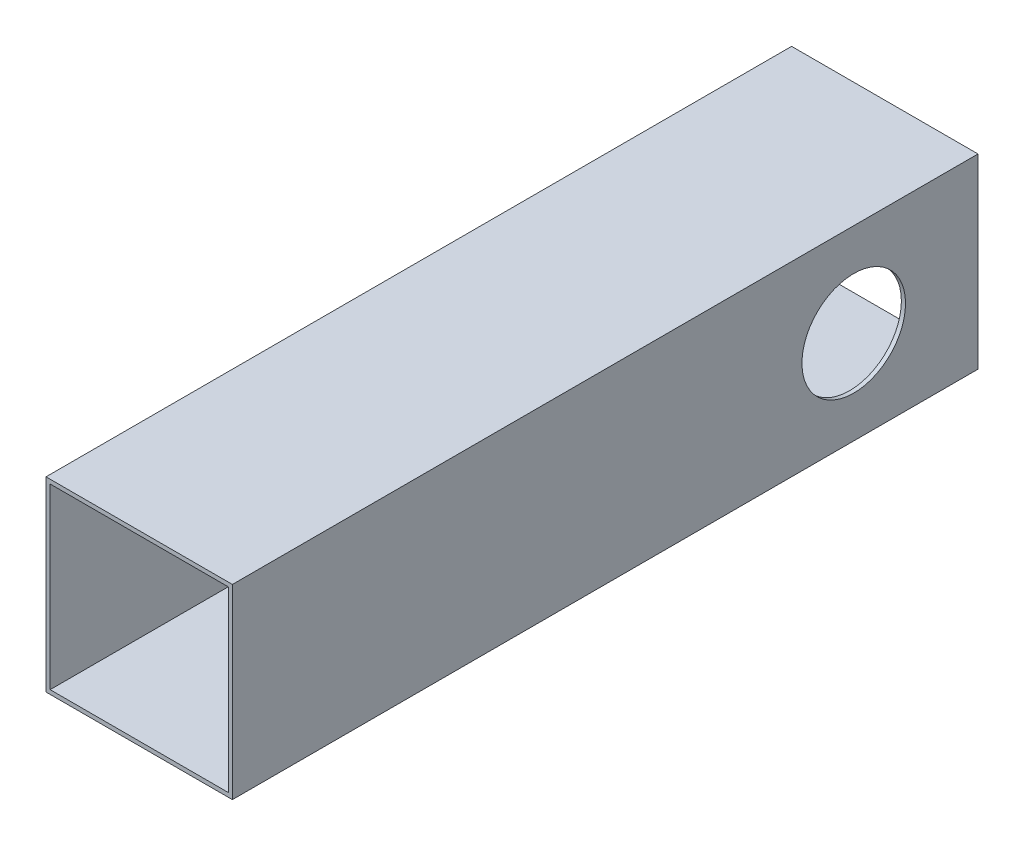
ISO-10303-21;
HEADER;
FILE_DESCRIPTION(('STEP AP214'),'2;1');
FILE_NAME('part.step','',(''),(''),'','','');
FILE_SCHEMA(('AUTOMOTIVE_DESIGN { 1 0 10303 214 1 1 1 1 }'));
ENDSEC;
DATA;
#1=APPLICATION_CONTEXT('core data for automotive mechanical design processes');
#2=APPLICATION_PROTOCOL_DEFINITION('international standard','automotive_design',2000,#1);
#3=PRODUCT_CONTEXT('',#1,'mechanical');
#4=PRODUCT('Part','Part','',(#3));
#5=PRODUCT_RELATED_PRODUCT_CATEGORY('part','',(#4));
#6=PRODUCT_DEFINITION_FORMATION('','',#4);
#7=PRODUCT_DEFINITION_CONTEXT('part definition',#1,'design');
#8=PRODUCT_DEFINITION('design','',#6,#7);
#9=PRODUCT_DEFINITION_SHAPE('','',#8);
#10=(LENGTH_UNIT() NAMED_UNIT(*) SI_UNIT(.MILLI.,.METRE.));
#11=(NAMED_UNIT(*) PLANE_ANGLE_UNIT() SI_UNIT($,.RADIAN.));
#12=(NAMED_UNIT(*) SI_UNIT($,.STERADIAN.) SOLID_ANGLE_UNIT());
#13=UNCERTAINTY_MEASURE_WITH_UNIT(LENGTH_MEASURE(1.E-05),#10,'distance_accuracy_value','');
#14=(GEOMETRIC_REPRESENTATION_CONTEXT(3) GLOBAL_UNCERTAINTY_ASSIGNED_CONTEXT((#13)) GLOBAL_UNIT_ASSIGNED_CONTEXT((#10,
#11,#12)) REPRESENTATION_CONTEXT('',''));
#15=CARTESIAN_POINT('',(0.,0.,0.));
#16=DIRECTION('',(0.,0.,1.));
#17=DIRECTION('',(1.,0.,0.));
#18=AXIS2_PLACEMENT_3D('',#15,#16,#17);
#19=CARTESIAN_POINT('',(0.,0.,180.));
#20=DIRECTION('',(0.,0.,-1.));
#21=DIRECTION('',(-1.,0.,0.));
#22=AXIS2_PLACEMENT_3D('',#19,#20,#21);
#23=PLANE('',#22);
#24=DIRECTION('',(0.,1.,0.));
#25=VECTOR('',#24,1.);
#26=CARTESIAN_POINT('',(22.5,-22.5,180.));
#27=LINE('',#26,#25);
#28=CARTESIAN_POINT('',(22.5,-22.5,180.));
#29=VERTEX_POINT('',#28);
#30=CARTESIAN_POINT('',(22.5,22.5,180.));
#31=VERTEX_POINT('',#30);
#32=EDGE_CURVE('E156',#29,#31,#27,.T.);
#33=ORIENTED_EDGE('',*,*,#32,.T.);
#34=DIRECTION('',(-1.,0.,0.));
#35=VECTOR('',#34,1.);
#36=CARTESIAN_POINT('',(-22.5,22.5,180.));
#37=LINE('',#36,#35);
#38=CARTESIAN_POINT('',(-22.5,22.5,180.));
#39=VERTEX_POINT('',#38);
#40=EDGE_CURVE('E160',#31,#39,#37,.T.);
#41=ORIENTED_EDGE('',*,*,#40,.T.);
#42=DIRECTION('',(0.,-1.,0.));
#43=VECTOR('',#42,1.);
#44=CARTESIAN_POINT('',(-22.5,-22.5,180.));
#45=LINE('',#44,#43);
#46=CARTESIAN_POINT('',(-22.5,-22.5,180.));
#47=VERTEX_POINT('',#46);
#48=EDGE_CURVE('E164',#39,#47,#45,.T.);
#49=ORIENTED_EDGE('',*,*,#48,.T.);
#50=DIRECTION('',(1.,0.,0.));
#51=VECTOR('',#50,1.);
#52=CARTESIAN_POINT('',(-22.5,-22.5,180.));
#53=LINE('',#52,#51);
#54=EDGE_CURVE('E167',#47,#29,#53,.T.);
#55=ORIENTED_EDGE('',*,*,#54,.T.);
#56=EDGE_LOOP('',(#33,#41,#49,#55));
#57=FACE_BOUND('',#56,.T.);
#58=DIRECTION('',(0.,1.,0.));
#59=VECTOR('',#58,1.);
#60=CARTESIAN_POINT('',(21.5,-21.5,180.));
#61=LINE('',#60,#59);
#62=CARTESIAN_POINT('',(21.5,-21.5,180.));
#63=VERTEX_POINT('',#62);
#64=CARTESIAN_POINT('',(21.5,21.5,180.));
#65=VERTEX_POINT('',#64);
#66=EDGE_CURVE('E106',#63,#65,#61,.T.);
#67=ORIENTED_EDGE('',*,*,#66,.F.);
#68=DIRECTION('',(1.,0.,0.));
#69=VECTOR('',#68,1.);
#70=CARTESIAN_POINT('',(-21.5,-21.5,180.));
#71=LINE('',#70,#69);
#72=CARTESIAN_POINT('',(-21.5,-21.5,180.));
#73=VERTEX_POINT('',#72);
#74=EDGE_CURVE('E132',#73,#63,#71,.T.);
#75=ORIENTED_EDGE('',*,*,#74,.F.);
#76=DIRECTION('',(0.,-1.,0.));
#77=VECTOR('',#76,1.);
#78=CARTESIAN_POINT('',(-21.5,-21.5,180.));
#79=LINE('',#78,#77);
#80=CARTESIAN_POINT('',(-21.5,21.5,180.));
#81=VERTEX_POINT('',#80);
#82=EDGE_CURVE('E128',#81,#73,#79,.T.);
#83=ORIENTED_EDGE('',*,*,#82,.F.);
#84=DIRECTION('',(-1.,0.,0.));
#85=VECTOR('',#84,1.);
#86=CARTESIAN_POINT('',(-21.5,21.5,180.));
#87=LINE('',#86,#85);
#88=EDGE_CURVE('E115',#65,#81,#87,.T.);
#89=ORIENTED_EDGE('',*,*,#88,.F.);
#90=EDGE_LOOP('',(#67,#75,#83,#89));
#91=FACE_BOUND('',#90,.T.);
#92=ADVANCED_FACE('F39',(#57,#91),#23,.F.);
#93=CARTESIAN_POINT('',(0.,0.,0.));
#94=DIRECTION('',(0.,0.,-1.));
#95=DIRECTION('',(-1.,0.,0.));
#96=AXIS2_PLACEMENT_3D('',#93,#94,#95);
#97=PLANE('',#96);
#98=DIRECTION('',(0.,1.,0.));
#99=VECTOR('',#98,1.);
#100=CARTESIAN_POINT('',(22.5,-22.5,0.));
#101=LINE('',#100,#99);
#102=CARTESIAN_POINT('',(22.5,-22.5,0.));
#103=VERTEX_POINT('',#102);
#104=CARTESIAN_POINT('',(22.5,22.5,0.));
#105=VERTEX_POINT('',#104);
#106=EDGE_CURVE('E124',#103,#105,#101,.T.);
#107=ORIENTED_EDGE('',*,*,#106,.F.);
#108=DIRECTION('',(1.,0.,0.));
#109=VECTOR('',#108,1.);
#110=CARTESIAN_POINT('',(-22.5,-22.5,0.));
#111=LINE('',#110,#109);
#112=CARTESIAN_POINT('',(-22.5,-22.5,0.));
#113=VERTEX_POINT('',#112);
#114=EDGE_CURVE('E161',#113,#103,#111,.T.);
#115=ORIENTED_EDGE('',*,*,#114,.F.);
#116=DIRECTION('',(0.,-1.,0.));
#117=VECTOR('',#116,1.);
#118=CARTESIAN_POINT('',(-22.5,-22.5,0.));
#119=LINE('',#118,#117);
#120=CARTESIAN_POINT('',(-22.5,22.5,0.));
#121=VERTEX_POINT('',#120);
#122=EDGE_CURVE('E177',#121,#113,#119,.T.);
#123=ORIENTED_EDGE('',*,*,#122,.F.);
#124=DIRECTION('',(-1.,0.,0.));
#125=VECTOR('',#124,1.);
#126=CARTESIAN_POINT('',(-22.5,22.5,0.));
#127=LINE('',#126,#125);
#128=EDGE_CURVE('E174',#105,#121,#127,.T.);
#129=ORIENTED_EDGE('',*,*,#128,.F.);
#130=EDGE_LOOP('',(#107,#115,#123,#129));
#131=FACE_BOUND('',#130,.T.);
#132=DIRECTION('',(1.,0.,0.));
#133=VECTOR('',#132,1.);
#134=CARTESIAN_POINT('',(-21.5,-21.5,0.));
#135=LINE('',#134,#133);
#136=CARTESIAN_POINT('',(-21.5,-21.5,0.));
#137=VERTEX_POINT('',#136);
#138=CARTESIAN_POINT('',(21.5,-21.5,0.));
#139=VERTEX_POINT('',#138);
#140=EDGE_CURVE('E116',#137,#139,#135,.T.);
#141=ORIENTED_EDGE('',*,*,#140,.T.);
#142=DIRECTION('',(0.,1.,0.));
#143=VECTOR('',#142,1.);
#144=CARTESIAN_POINT('',(21.5,-21.5,0.));
#145=LINE('',#144,#143);
#146=CARTESIAN_POINT('',(21.5,21.5,0.));
#147=VERTEX_POINT('',#146);
#148=EDGE_CURVE('E64',#139,#147,#145,.T.);
#149=ORIENTED_EDGE('',*,*,#148,.T.);
#150=DIRECTION('',(-1.,0.,0.));
#151=VECTOR('',#150,1.);
#152=CARTESIAN_POINT('',(-21.5,21.5,0.));
#153=LINE('',#152,#151);
#154=CARTESIAN_POINT('',(-21.5,21.5,0.));
#155=VERTEX_POINT('',#154);
#156=EDGE_CURVE('E122',#147,#155,#153,.T.);
#157=ORIENTED_EDGE('',*,*,#156,.T.);
#158=DIRECTION('',(0.,-1.,0.));
#159=VECTOR('',#158,1.);
#160=CARTESIAN_POINT('',(-21.5,-21.5,0.));
#161=LINE('',#160,#159);
#162=EDGE_CURVE('E143',#155,#137,#161,.T.);
#163=ORIENTED_EDGE('',*,*,#162,.T.);
#164=EDGE_LOOP('',(#141,#149,#157,#163));
#165=FACE_BOUND('',#164,.T.);
#166=ADVANCED_FACE('F201',(#131,#165),#97,.T.);
#167=CARTESIAN_POINT('',(22.5,-22.5,180.));
#168=DIRECTION('',(-1.,0.,0.));
#169=DIRECTION('',(0.,0.,1.));
#170=AXIS2_PLACEMENT_3D('',#167,#168,#169);
#171=PLANE('',#170);
#172=CARTESIAN_POINT('',(22.5,0.,30.));
#173=DIRECTION('',(1.,0.,0.));
#174=DIRECTION('',(0.,0.,-1.));
#175=AXIS2_PLACEMENT_3D('',#172,#173,#174);
#176=CIRCLE('',#175,12.5);
#177=CARTESIAN_POINT('',(22.5,0.,17.5));
#178=VERTEX_POINT('',#177);
#179=EDGE_CURVE('E248',#178,#178,#176,.T.);
#180=ORIENTED_EDGE('',*,*,#179,.F.);
#181=EDGE_LOOP('',(#180));
#182=FACE_BOUND('',#181,.T.);
#183=ORIENTED_EDGE('',*,*,#106,.T.);
#184=DIRECTION('',(0.,0.,-1.));
#185=VECTOR('',#184,1.);
#186=CARTESIAN_POINT('',(22.5,22.5,180.));
#187=LINE('',#186,#185);
#188=EDGE_CURVE('E11',#31,#105,#187,.T.);
#189=ORIENTED_EDGE('',*,*,#188,.F.);
#190=ORIENTED_EDGE('',*,*,#32,.F.);
#191=DIRECTION('',(0.,0.,-1.));
#192=VECTOR('',#191,1.);
#193=CARTESIAN_POINT('',(22.5,-22.5,180.));
#194=LINE('',#193,#192);
#195=EDGE_CURVE('E170',#29,#103,#194,.T.);
#196=ORIENTED_EDGE('',*,*,#195,.T.);
#197=EDGE_LOOP('',(#183,#189,#190,#196));
#198=FACE_BOUND('',#197,.T.);
#199=ADVANCED_FACE('F41',(#182,#198),#171,.F.);
#200=CARTESIAN_POINT('',(-22.5,22.5,180.));
#201=DIRECTION('',(0.,-1.,0.));
#202=DIRECTION('',(0.,0.,-1.));
#203=AXIS2_PLACEMENT_3D('',#200,#201,#202);
#204=PLANE('',#203);
#205=ORIENTED_EDGE('',*,*,#128,.T.);
#206=DIRECTION('',(0.,0.,-1.));
#207=VECTOR('',#206,1.);
#208=CARTESIAN_POINT('',(-22.5,22.5,180.));
#209=LINE('',#208,#207);
#210=EDGE_CURVE('E49',#39,#121,#209,.T.);
#211=ORIENTED_EDGE('',*,*,#210,.F.);
#212=ORIENTED_EDGE('',*,*,#40,.F.);
#213=ORIENTED_EDGE('',*,*,#188,.T.);
#214=EDGE_LOOP('',(#205,#211,#212,#213));
#215=FACE_BOUND('',#214,.T.);
#216=ADVANCED_FACE('F211',(#215),#204,.F.);
#217=CARTESIAN_POINT('',(-22.5,-22.5,180.));
#218=DIRECTION('',(1.,0.,0.));
#219=DIRECTION('',(0.,0.,-1.));
#220=AXIS2_PLACEMENT_3D('',#217,#218,#219);
#221=PLANE('',#220);
#222=CARTESIAN_POINT('',(-22.5,0.,30.));
#223=DIRECTION('',(1.,0.,0.));
#224=DIRECTION('',(0.,0.,-1.));
#225=AXIS2_PLACEMENT_3D('',#222,#223,#224);
#226=CIRCLE('',#225,12.5);
#227=CARTESIAN_POINT('',(-22.5,0.,17.5));
#228=VERTEX_POINT('',#227);
#229=EDGE_CURVE('E140',#228,#228,#226,.T.);
#230=ORIENTED_EDGE('',*,*,#229,.T.);
#231=EDGE_LOOP('',(#230));
#232=FACE_BOUND('',#231,.T.);
#233=ORIENTED_EDGE('',*,*,#122,.T.);
#234=DIRECTION('',(0.,0.,-1.));
#235=VECTOR('',#234,1.);
#236=CARTESIAN_POINT('',(-22.5,-22.5,180.));
#237=LINE('',#236,#235);
#238=EDGE_CURVE('E185',#47,#113,#237,.T.);
#239=ORIENTED_EDGE('',*,*,#238,.F.);
#240=ORIENTED_EDGE('',*,*,#48,.F.);
#241=ORIENTED_EDGE('',*,*,#210,.T.);
#242=EDGE_LOOP('',(#233,#239,#240,#241));
#243=FACE_BOUND('',#242,.T.);
#244=ADVANCED_FACE('F195',(#232,#243),#221,.F.);
#245=CARTESIAN_POINT('',(-22.5,-22.5,180.));
#246=DIRECTION('',(0.,1.,0.));
#247=DIRECTION('',(0.,0.,1.));
#248=AXIS2_PLACEMENT_3D('',#245,#246,#247);
#249=PLANE('',#248);
#250=ORIENTED_EDGE('',*,*,#114,.T.);
#251=ORIENTED_EDGE('',*,*,#195,.F.);
#252=ORIENTED_EDGE('',*,*,#54,.F.);
#253=ORIENTED_EDGE('',*,*,#238,.T.);
#254=EDGE_LOOP('',(#250,#251,#252,#253));
#255=FACE_BOUND('',#254,.T.);
#256=ADVANCED_FACE('F205',(#255),#249,.F.);
#257=CARTESIAN_POINT('',(21.5,-21.5,180.));
#258=DIRECTION('',(-1.,0.,0.));
#259=DIRECTION('',(0.,0.,1.));
#260=AXIS2_PLACEMENT_3D('',#257,#258,#259);
#261=PLANE('',#260);
#262=CARTESIAN_POINT('',(21.5,0.,30.));
#263=DIRECTION('',(-1.,0.,0.));
#264=DIRECTION('',(0.,0.,1.));
#265=AXIS2_PLACEMENT_3D('',#262,#263,#264);
#266=CIRCLE('',#265,12.5);
#267=CARTESIAN_POINT('',(21.5,0.,42.5));
#268=VERTEX_POINT('',#267);
#269=EDGE_CURVE('E240',#268,#268,#266,.T.);
#270=ORIENTED_EDGE('',*,*,#269,.F.);
#271=EDGE_LOOP('',(#270));
#272=FACE_BOUND('',#271,.T.);
#273=ORIENTED_EDGE('',*,*,#148,.F.);
#274=DIRECTION('',(0.,0.,-1.));
#275=VECTOR('',#274,1.);
#276=CARTESIAN_POINT('',(21.5,-21.5,180.));
#277=LINE('',#276,#275);
#278=EDGE_CURVE('E110',#63,#139,#277,.T.);
#279=ORIENTED_EDGE('',*,*,#278,.F.);
#280=ORIENTED_EDGE('',*,*,#66,.T.);
#281=DIRECTION('',(0.,0.,-1.));
#282=VECTOR('',#281,1.);
#283=CARTESIAN_POINT('',(21.5,21.5,180.));
#284=LINE('',#283,#282);
#285=EDGE_CURVE('E109',#65,#147,#284,.T.);
#286=ORIENTED_EDGE('',*,*,#285,.T.);
#287=EDGE_LOOP('',(#273,#279,#280,#286));
#288=FACE_BOUND('',#287,.T.);
#289=ADVANCED_FACE('F108',(#272,#288),#261,.T.);
#290=CARTESIAN_POINT('',(-21.5,21.5,180.));
#291=DIRECTION('',(0.,-1.,0.));
#292=DIRECTION('',(0.,0.,-1.));
#293=AXIS2_PLACEMENT_3D('',#290,#291,#292);
#294=PLANE('',#293);
#295=ORIENTED_EDGE('',*,*,#156,.F.);
#296=ORIENTED_EDGE('',*,*,#285,.F.);
#297=ORIENTED_EDGE('',*,*,#88,.T.);
#298=DIRECTION('',(0.,0.,-1.));
#299=VECTOR('',#298,1.);
#300=CARTESIAN_POINT('',(-21.5,21.5,180.));
#301=LINE('',#300,#299);
#302=EDGE_CURVE('E125',#81,#155,#301,.T.);
#303=ORIENTED_EDGE('',*,*,#302,.T.);
#304=EDGE_LOOP('',(#295,#296,#297,#303));
#305=FACE_BOUND('',#304,.T.);
#306=ADVANCED_FACE('F119',(#305),#294,.T.);
#307=CARTESIAN_POINT('',(-21.5,-21.5,180.));
#308=DIRECTION('',(1.,0.,0.));
#309=DIRECTION('',(0.,0.,-1.));
#310=AXIS2_PLACEMENT_3D('',#307,#308,#309);
#311=PLANE('',#310);
#312=CARTESIAN_POINT('',(-21.5,0.,30.));
#313=DIRECTION('',(1.,0.,0.));
#314=DIRECTION('',(0.,0.,-1.));
#315=AXIS2_PLACEMENT_3D('',#312,#313,#314);
#316=CIRCLE('',#315,12.5);
#317=CARTESIAN_POINT('',(-21.5,0.,17.5));
#318=VERTEX_POINT('',#317);
#319=EDGE_CURVE('E43',#318,#318,#316,.T.);
#320=ORIENTED_EDGE('',*,*,#319,.F.);
#321=EDGE_LOOP('',(#320));
#322=FACE_BOUND('',#321,.T.);
#323=ORIENTED_EDGE('',*,*,#162,.F.);
#324=ORIENTED_EDGE('',*,*,#302,.F.);
#325=ORIENTED_EDGE('',*,*,#82,.T.);
#326=DIRECTION('',(0.,0.,-1.));
#327=VECTOR('',#326,1.);
#328=CARTESIAN_POINT('',(-21.5,-21.5,180.));
#329=LINE('',#328,#327);
#330=EDGE_CURVE('E56',#73,#137,#329,.T.);
#331=ORIENTED_EDGE('',*,*,#330,.T.);
#332=EDGE_LOOP('',(#323,#324,#325,#331));
#333=FACE_BOUND('',#332,.T.);
#334=ADVANCED_FACE('F237',(#322,#333),#311,.T.);
#335=CARTESIAN_POINT('',(-21.5,-21.5,180.));
#336=DIRECTION('',(0.,1.,0.));
#337=DIRECTION('',(0.,0.,1.));
#338=AXIS2_PLACEMENT_3D('',#335,#336,#337);
#339=PLANE('',#338);
#340=ORIENTED_EDGE('',*,*,#140,.F.);
#341=ORIENTED_EDGE('',*,*,#330,.F.);
#342=ORIENTED_EDGE('',*,*,#74,.T.);
#343=ORIENTED_EDGE('',*,*,#278,.T.);
#344=EDGE_LOOP('',(#340,#341,#342,#343));
#345=FACE_BOUND('',#344,.T.);
#346=ADVANCED_FACE('F261',(#345),#339,.T.);
#347=CARTESIAN_POINT('',(-157.5,0.,30.));
#348=DIRECTION('',(1.,0.,0.));
#349=DIRECTION('',(0.,0.,-1.));
#350=AXIS2_PLACEMENT_3D('',#347,#348,#349);
#351=CYLINDRICAL_SURFACE('',#350,12.5);
#352=ORIENTED_EDGE('',*,*,#319,.T.);
#353=EDGE_LOOP('',(#352));
#354=FACE_BOUND('',#353,.T.);
#355=ORIENTED_EDGE('',*,*,#229,.F.);
#356=EDGE_LOOP('',(#355));
#357=FACE_BOUND('',#356,.T.);
#358=ADVANCED_FACE('F256',(#354,#357),#351,.F.);
#359=ORIENTED_EDGE('',*,*,#269,.T.);
#360=EDGE_LOOP('',(#359));
#361=FACE_BOUND('',#360,.T.);
#362=ORIENTED_EDGE('',*,*,#179,.T.);
#363=EDGE_LOOP('',(#362));
#364=FACE_BOUND('',#363,.T.);
#365=ADVANCED_FACE('F254',(#361,#364),#351,.F.);
#366=CLOSED_SHELL('',(#92,#166,#199,#216,#244,#256,#289,#306,#334,#346,#358,#365));
#367=MANIFOLD_SOLID_BREP('B2',#366);
#368=ADVANCED_BREP_SHAPE_REPRESENTATION('',(#18,#367),#14);
#369=SHAPE_DEFINITION_REPRESENTATION(#9,#368);
ENDSEC;
END-ISO-10303-21;
